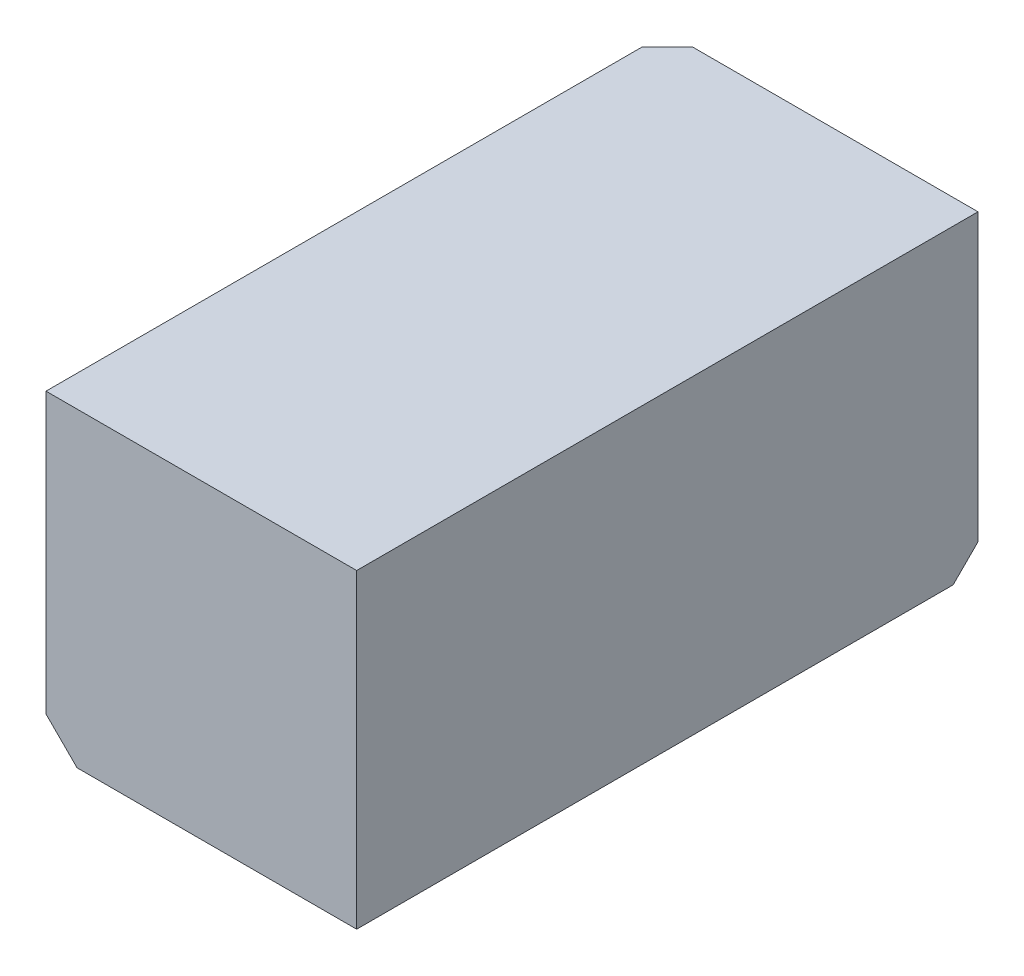
ISO-10303-21;
HEADER;
FILE_DESCRIPTION(('STEP AP214'),'2;1');
FILE_NAME('part.step','',(''),(''),'','','');
FILE_SCHEMA(('AUTOMOTIVE_DESIGN { 1 0 10303 214 1 1 1 1 }'));
ENDSEC;
DATA;
#1=APPLICATION_CONTEXT('core data for automotive mechanical design processes');
#2=APPLICATION_PROTOCOL_DEFINITION('international standard','automotive_design',2000,#1);
#3=PRODUCT_CONTEXT('',#1,'mechanical');
#4=PRODUCT('Part','Part','',(#3));
#5=PRODUCT_RELATED_PRODUCT_CATEGORY('part','',(#4));
#6=PRODUCT_DEFINITION_FORMATION('','',#4);
#7=PRODUCT_DEFINITION_CONTEXT('part definition',#1,'design');
#8=PRODUCT_DEFINITION('design','',#6,#7);
#9=PRODUCT_DEFINITION_SHAPE('','',#8);
#10=(LENGTH_UNIT() NAMED_UNIT(*) SI_UNIT(.MILLI.,.METRE.));
#11=(NAMED_UNIT(*) PLANE_ANGLE_UNIT() SI_UNIT($,.RADIAN.));
#12=(NAMED_UNIT(*) SI_UNIT($,.STERADIAN.) SOLID_ANGLE_UNIT());
#13=UNCERTAINTY_MEASURE_WITH_UNIT(LENGTH_MEASURE(1.E-05),#10,'distance_accuracy_value','');
#14=(GEOMETRIC_REPRESENTATION_CONTEXT(3) GLOBAL_UNCERTAINTY_ASSIGNED_CONTEXT((#13)) GLOBAL_UNIT_ASSIGNED_CONTEXT((#10,
#11,#12)) REPRESENTATION_CONTEXT('',''));
#15=CARTESIAN_POINT('',(0.,0.,0.));
#16=DIRECTION('',(0.,0.,1.));
#17=DIRECTION('',(1.,0.,0.));
#18=AXIS2_PLACEMENT_3D('',#15,#16,#17);
#19=CARTESIAN_POINT('',(-2.5,2.5,10.));
#20=DIRECTION('',(1.,0.,0.));
#21=DIRECTION('',(0.,0.,-1.));
#22=AXIS2_PLACEMENT_3D('',#19,#20,#21);
#23=PLANE('',#22);
#24=CARTESIAN_POINT('',(-2.5,0.,2.5));
#25=DIRECTION('',(-1.,0.,0.));
#26=DIRECTION('',(0.,0.,1.));
#27=AXIS2_PLACEMENT_3D('',#24,#25,#26);
#28=CIRCLE('',#27,1.6);
#29=CARTESIAN_POINT('',(-2.5,0.,4.1));
#30=VERTEX_POINT('',#29);
#31=EDGE_CURVE('E154',#30,#30,#28,.T.);
#32=ORIENTED_EDGE('',*,*,#31,.F.);
#33=EDGE_LOOP('',(#32));
#34=FACE_BOUND('',#33,.T.);
#35=DIRECTION('',(0.,0.,-1.));
#36=VECTOR('',#35,1.);
#37=CARTESIAN_POINT('',(-2.5,2.5,10.));
#38=LINE('',#37,#36);
#39=CARTESIAN_POINT('',(-2.5,2.5,10.));
#40=VERTEX_POINT('',#39);
#41=CARTESIAN_POINT('',(-2.5,2.5,0.4));
#42=VERTEX_POINT('',#41);
#43=EDGE_CURVE('E119',#40,#42,#38,.T.);
#44=ORIENTED_EDGE('',*,*,#43,.T.);
#45=DIRECTION('',(0.,-1.,0.));
#46=VECTOR('',#45,1.);
#47=CARTESIAN_POINT('',(-2.5,2.5,0.400000000000001));
#48=LINE('',#47,#46);
#49=CARTESIAN_POINT('',(-2.5,-2.,0.400000000000001));
#50=VERTEX_POINT('',#49);
#51=EDGE_CURVE('E136',#42,#50,#48,.T.);
#52=ORIENTED_EDGE('',*,*,#51,.T.);
#53=DIRECTION('',(0.,0.,1.));
#54=VECTOR('',#53,1.);
#55=CARTESIAN_POINT('',(-2.5,-2.,10.));
#56=LINE('',#55,#54);
#57=CARTESIAN_POINT('',(-2.5,-2.,10.));
#58=VERTEX_POINT('',#57);
#59=EDGE_CURVE('E133',#50,#58,#56,.T.);
#60=ORIENTED_EDGE('',*,*,#59,.T.);
#61=DIRECTION('',(0.,-1.,0.));
#62=VECTOR('',#61,1.);
#63=CARTESIAN_POINT('',(-2.5,2.5,10.));
#64=LINE('',#63,#62);
#65=EDGE_CURVE('E105',#40,#58,#64,.T.);
#66=ORIENTED_EDGE('',*,*,#65,.F.);
#67=EDGE_LOOP('',(#44,#52,#60,#66));
#68=FACE_BOUND('',#67,.T.);
#69=ADVANCED_FACE('F36',(#34,#68),#23,.F.);
#70=CARTESIAN_POINT('',(-2.5,-2.5,10.));
#71=DIRECTION('',(0.,1.,0.));
#72=DIRECTION('',(0.,0.,1.));
#73=AXIS2_PLACEMENT_3D('',#70,#71,#72);
#74=PLANE('',#73);
#75=CARTESIAN_POINT('',(0.,-2.5,7.5));
#76=DIRECTION('',(0.,-1.,0.));
#77=DIRECTION('',(0.,0.,-1.));
#78=AXIS2_PLACEMENT_3D('',#75,#76,#77);
#79=CIRCLE('',#78,1.6);
#80=CARTESIAN_POINT('',(0.,-2.5,5.9));
#81=VERTEX_POINT('',#80);
#82=EDGE_CURVE('E164',#81,#81,#79,.T.);
#83=ORIENTED_EDGE('',*,*,#82,.F.);
#84=EDGE_LOOP('',(#83));
#85=FACE_BOUND('',#84,.T.);
#86=DIRECTION('',(0.,0.,-1.));
#87=VECTOR('',#86,1.);
#88=CARTESIAN_POINT('',(-2.,-2.5,10.));
#89=LINE('',#88,#87);
#90=CARTESIAN_POINT('',(-2.,-2.5,10.));
#91=VERTEX_POINT('',#90);
#92=CARTESIAN_POINT('',(-2.,-2.5,0.400000000000001));
#93=VERTEX_POINT('',#92);
#94=EDGE_CURVE('E111',#91,#93,#89,.T.);
#95=ORIENTED_EDGE('',*,*,#94,.T.);
#96=DIRECTION('',(1.,0.,0.));
#97=VECTOR('',#96,1.);
#98=CARTESIAN_POINT('',(-2.5,-2.5,0.400000000000001));
#99=LINE('',#98,#97);
#100=CARTESIAN_POINT('',(2.5,-2.5,0.4));
#101=VERTEX_POINT('',#100);
#102=EDGE_CURVE('E45',#93,#101,#99,.T.);
#103=ORIENTED_EDGE('',*,*,#102,.T.);
#104=DIRECTION('',(0.,0.,-1.));
#105=VECTOR('',#104,1.);
#106=CARTESIAN_POINT('',(2.5,-2.5,10.));
#107=LINE('',#106,#105);
#108=CARTESIAN_POINT('',(2.5,-2.5,10.));
#109=VERTEX_POINT('',#108);
#110=EDGE_CURVE('E107',#109,#101,#107,.T.);
#111=ORIENTED_EDGE('',*,*,#110,.F.);
#112=DIRECTION('',(1.,0.,0.));
#113=VECTOR('',#112,1.);
#114=CARTESIAN_POINT('',(-2.5,-2.5,10.));
#115=LINE('',#114,#113);
#116=EDGE_CURVE('E97',#91,#109,#115,.T.);
#117=ORIENTED_EDGE('',*,*,#116,.F.);
#118=EDGE_LOOP('',(#95,#103,#111,#117));
#119=FACE_BOUND('',#118,.T.);
#120=ADVANCED_FACE('F108',(#85,#119),#74,.F.);
#121=CARTESIAN_POINT('',(2.5,2.5,10.));
#122=DIRECTION('',(-1.,0.,0.));
#123=DIRECTION('',(0.,0.,1.));
#124=AXIS2_PLACEMENT_3D('',#121,#122,#123);
#125=PLANE('',#124);
#126=ORIENTED_EDGE('',*,*,#110,.T.);
#127=DIRECTION('',(0.,-0.707106781186549,0.707106781186546));
#128=VECTOR('',#127,1.);
#129=CARTESIAN_POINT('',(2.5,-2.5,0.400000000000001));
#130=LINE('',#129,#128);
#131=CARTESIAN_POINT('',(2.5,-2.1,0.));
#132=VERTEX_POINT('',#131);
#133=EDGE_CURVE('E11',#101,#132,#130,.F.);
#134=ORIENTED_EDGE('',*,*,#133,.T.);
#135=DIRECTION('',(0.,1.,0.));
#136=VECTOR('',#135,1.);
#137=CARTESIAN_POINT('',(2.5,2.5,0.));
#138=LINE('',#137,#136);
#139=CARTESIAN_POINT('',(2.5,2.5,0.));
#140=VERTEX_POINT('',#139);
#141=EDGE_CURVE('E123',#132,#140,#138,.T.);
#142=ORIENTED_EDGE('',*,*,#141,.T.);
#143=DIRECTION('',(0.,0.,-1.));
#144=VECTOR('',#143,1.);
#145=CARTESIAN_POINT('',(2.5,2.5,10.));
#146=LINE('',#145,#144);
#147=CARTESIAN_POINT('',(2.5,2.5,10.));
#148=VERTEX_POINT('',#147);
#149=EDGE_CURVE('E112',#148,#140,#146,.T.);
#150=ORIENTED_EDGE('',*,*,#149,.F.);
#151=DIRECTION('',(0.,1.,0.));
#152=VECTOR('',#151,1.);
#153=CARTESIAN_POINT('',(2.5,2.5,10.));
#154=LINE('',#153,#152);
#155=EDGE_CURVE('E101',#109,#148,#154,.T.);
#156=ORIENTED_EDGE('',*,*,#155,.F.);
#157=EDGE_LOOP('',(#126,#134,#142,#150,#156));
#158=FACE_BOUND('',#157,.T.);
#159=ADVANCED_FACE('F114',(#158),#125,.F.);
#160=CARTESIAN_POINT('',(-2.5,2.5,10.));
#161=DIRECTION('',(0.,-1.,0.));
#162=DIRECTION('',(0.,0.,-1.));
#163=AXIS2_PLACEMENT_3D('',#160,#161,#162);
#164=PLANE('',#163);
#165=DIRECTION('',(-1.,0.,0.));
#166=VECTOR('',#165,1.);
#167=CARTESIAN_POINT('',(-2.5,2.5,0.));
#168=LINE('',#167,#166);
#169=CARTESIAN_POINT('',(-2.1,2.5,0.));
#170=VERTEX_POINT('',#169);
#171=EDGE_CURVE('E125',#140,#170,#168,.T.);
#172=ORIENTED_EDGE('',*,*,#171,.T.);
#173=DIRECTION('',(0.707106781186549,0.,-0.707106781186546));
#174=VECTOR('',#173,1.);
#175=CARTESIAN_POINT('',(-2.5,2.5,0.400000000000001));
#176=LINE('',#175,#174);
#177=EDGE_CURVE('E145',#170,#42,#176,.F.);
#178=ORIENTED_EDGE('',*,*,#177,.T.);
#179=ORIENTED_EDGE('',*,*,#43,.F.);
#180=DIRECTION('',(-1.,0.,0.));
#181=VECTOR('',#180,1.);
#182=CARTESIAN_POINT('',(-2.5,2.5,10.));
#183=LINE('',#182,#181);
#184=EDGE_CURVE('E117',#148,#40,#183,.T.);
#185=ORIENTED_EDGE('',*,*,#184,.F.);
#186=ORIENTED_EDGE('',*,*,#149,.T.);
#187=EDGE_LOOP('',(#172,#178,#179,#185,#186));
#188=FACE_BOUND('',#187,.T.);
#189=ADVANCED_FACE('F182',(#188),#164,.F.);
#190=CARTESIAN_POINT('',(0.,0.,10.));
#191=DIRECTION('',(0.,0.,1.));
#192=DIRECTION('',(1.,0.,0.));
#193=AXIS2_PLACEMENT_3D('',#190,#191,#192);
#194=PLANE('',#193);
#195=ORIENTED_EDGE('',*,*,#65,.T.);
#196=DIRECTION('',(-0.707106781186546,0.707106781186549,0.));
#197=VECTOR('',#196,1.);
#198=CARTESIAN_POINT('',(-2.25,-2.25,10.));
#199=LINE('',#198,#197);
#200=EDGE_CURVE('E104',#58,#91,#199,.F.);
#201=ORIENTED_EDGE('',*,*,#200,.T.);
#202=ORIENTED_EDGE('',*,*,#116,.T.);
#203=ORIENTED_EDGE('',*,*,#155,.T.);
#204=ORIENTED_EDGE('',*,*,#184,.T.);
#205=EDGE_LOOP('',(#195,#201,#202,#203,#204));
#206=FACE_BOUND('',#205,.T.);
#207=ADVANCED_FACE('F99',(#206),#194,.T.);
#208=CARTESIAN_POINT('',(0.,0.,0.));
#209=DIRECTION('',(0.,0.,1.));
#210=DIRECTION('',(1.,0.,0.));
#211=AXIS2_PLACEMENT_3D('',#208,#209,#210);
#212=PLANE('',#211);
#213=DIRECTION('',(-0.707106781186546,0.707106781186549,0.));
#214=VECTOR('',#213,1.);
#215=CARTESIAN_POINT('',(-2.21715728752538,-1.71715728752538,0.));
#216=LINE('',#215,#214);
#217=CARTESIAN_POINT('',(-1.83431457505076,-2.1,0.));
#218=VERTEX_POINT('',#217);
#219=CARTESIAN_POINT('',(-2.1,-1.83431457505076,0.));
#220=VERTEX_POINT('',#219);
#221=EDGE_CURVE('E141',#218,#220,#216,.T.);
#222=ORIENTED_EDGE('',*,*,#221,.T.);
#223=DIRECTION('',(0.,1.,0.));
#224=VECTOR('',#223,1.);
#225=CARTESIAN_POINT('',(-2.1,0.,0.));
#226=LINE('',#225,#224);
#227=EDGE_CURVE('E143',#220,#170,#226,.T.);
#228=ORIENTED_EDGE('',*,*,#227,.T.);
#229=ORIENTED_EDGE('',*,*,#171,.F.);
#230=ORIENTED_EDGE('',*,*,#141,.F.);
#231=DIRECTION('',(-1.,0.,0.));
#232=VECTOR('',#231,1.);
#233=CARTESIAN_POINT('',(0.,-2.1,0.));
#234=LINE('',#233,#232);
#235=EDGE_CURVE('E139',#132,#218,#234,.T.);
#236=ORIENTED_EDGE('',*,*,#235,.T.);
#237=EDGE_LOOP('',(#222,#228,#229,#230,#236));
#238=FACE_BOUND('',#237,.T.);
#239=ADVANCED_FACE('F179',(#238),#212,.F.);
#240=CARTESIAN_POINT('',(0.,2.,7.5));
#241=DIRECTION('',(0.,-1.,0.));
#242=DIRECTION('',(0.,0.,-1.));
#243=AXIS2_PLACEMENT_3D('',#240,#241,#242);
#244=CYLINDRICAL_SURFACE('',#243,1.6);
#245=CARTESIAN_POINT('',(0.,2.,7.5));
#246=DIRECTION('',(0.,-1.,0.));
#247=DIRECTION('',(0.,0.,-1.));
#248=AXIS2_PLACEMENT_3D('',#245,#246,#247);
#249=CIRCLE('',#248,1.6);
#250=CARTESIAN_POINT('',(0.,2.,5.9));
#251=VERTEX_POINT('',#250);
#252=EDGE_CURVE('E126',#251,#251,#249,.T.);
#253=ORIENTED_EDGE('',*,*,#252,.F.);
#254=EDGE_LOOP('',(#253));
#255=FACE_BOUND('',#254,.T.);
#256=ORIENTED_EDGE('',*,*,#82,.T.);
#257=EDGE_LOOP('',(#256));
#258=FACE_BOUND('',#257,.T.);
#259=ADVANCED_FACE('F233',(#255,#258),#244,.F.);
#260=CARTESIAN_POINT('',(0.,2.,7.5));
#261=DIRECTION('',(0.,-1.,0.));
#262=DIRECTION('',(0.,0.,-1.));
#263=AXIS2_PLACEMENT_3D('',#260,#261,#262);
#264=PLANE('',#263);
#265=ORIENTED_EDGE('',*,*,#252,.T.);
#266=EDGE_LOOP('',(#265));
#267=FACE_BOUND('',#266,.T.);
#268=ADVANCED_FACE('F225',(#267),#264,.T.);
#269=CARTESIAN_POINT('',(2.,0.,2.5));
#270=DIRECTION('',(-1.,0.,0.));
#271=DIRECTION('',(0.,0.,1.));
#272=AXIS2_PLACEMENT_3D('',#269,#270,#271);
#273=CYLINDRICAL_SURFACE('',#272,1.6);
#274=CARTESIAN_POINT('',(2.,0.,2.5));
#275=DIRECTION('',(-1.,0.,0.));
#276=DIRECTION('',(0.,0.,1.));
#277=AXIS2_PLACEMENT_3D('',#274,#275,#276);
#278=CIRCLE('',#277,1.6);
#279=CARTESIAN_POINT('',(2.,0.,4.1));
#280=VERTEX_POINT('',#279);
#281=EDGE_CURVE('E159',#280,#280,#278,.T.);
#282=ORIENTED_EDGE('',*,*,#281,.F.);
#283=EDGE_LOOP('',(#282));
#284=FACE_BOUND('',#283,.T.);
#285=ORIENTED_EDGE('',*,*,#31,.T.);
#286=EDGE_LOOP('',(#285));
#287=FACE_BOUND('',#286,.T.);
#288=ADVANCED_FACE('F216',(#284,#287),#273,.F.);
#289=CARTESIAN_POINT('',(2.,0.,2.5));
#290=DIRECTION('',(-1.,0.,0.));
#291=DIRECTION('',(0.,0.,1.));
#292=AXIS2_PLACEMENT_3D('',#289,#290,#291);
#293=PLANE('',#292);
#294=ORIENTED_EDGE('',*,*,#281,.T.);
#295=EDGE_LOOP('',(#294));
#296=FACE_BOUND('',#295,.T.);
#297=ADVANCED_FACE('F196',(#296),#293,.T.);
#298=CARTESIAN_POINT('',(-2.,-2.5,10.));
#299=DIRECTION('',(0.707106781186549,0.707106781186546,0.));
#300=DIRECTION('',(0.,0.,-1.));
#301=AXIS2_PLACEMENT_3D('',#298,#299,#300);
#302=PLANE('',#301);
#303=ORIENTED_EDGE('',*,*,#59,.F.);
#304=DIRECTION('',(-0.707106781186546,0.707106781186549,0.));
#305=VECTOR('',#304,1.);
#306=CARTESIAN_POINT('',(-2.,-2.5,0.400000000000001));
#307=LINE('',#306,#305);
#308=EDGE_CURVE('E60',#50,#93,#307,.F.);
#309=ORIENTED_EDGE('',*,*,#308,.T.);
#310=ORIENTED_EDGE('',*,*,#94,.F.);
#311=ORIENTED_EDGE('',*,*,#200,.F.);
#312=EDGE_LOOP('',(#303,#309,#310,#311));
#313=FACE_BOUND('',#312,.T.);
#314=ADVANCED_FACE('F173',(#313),#302,.F.);
#315=CARTESIAN_POINT('',(-2.5,-2.5,0.400000000000001));
#316=DIRECTION('',(0.,0.707106781186546,0.707106781186549));
#317=DIRECTION('',(1.,0.,0.));
#318=AXIS2_PLACEMENT_3D('',#315,#316,#317);
#319=PLANE('',#318);
#320=ORIENTED_EDGE('',*,*,#133,.F.);
#321=ORIENTED_EDGE('',*,*,#102,.F.);
#322=DIRECTION('',(0.281084637714821,0.678598344545848,-0.678598344545845));
#323=VECTOR('',#322,1.);
#324=CARTESIAN_POINT('',(-2.03950428677964,-2.59537178491527,0.495371784915274));
#325=LINE('',#324,#323);
#326=EDGE_CURVE('E40',#218,#93,#325,.F.);
#327=ORIENTED_EDGE('',*,*,#326,.F.);
#328=ORIENTED_EDGE('',*,*,#235,.F.);
#329=EDGE_LOOP('',(#320,#321,#327,#328));
#330=FACE_BOUND('',#329,.T.);
#331=ADVANCED_FACE('F38',(#330),#319,.F.);
#332=CARTESIAN_POINT('',(-1.96715728752538,-1.96715728752538,0.));
#333=DIRECTION('',(0.5,0.499999999999998,0.707106781186549));
#334=DIRECTION('',(-0.707106781186546,0.707106781186549,0.));
#335=AXIS2_PLACEMENT_3D('',#332,#333,#334);
#336=PLANE('',#335);
#337=ORIENTED_EDGE('',*,*,#326,.T.);
#338=ORIENTED_EDGE('',*,*,#308,.F.);
#339=DIRECTION('',(0.678598344545848,0.28108463771482,-0.678598344545846));
#340=VECTOR('',#339,1.);
#341=CARTESIAN_POINT('',(-2.06416539357625,-1.81947139506774,-0.0358346064237448));
#342=LINE('',#341,#340);
#343=EDGE_CURVE('E148',#220,#50,#342,.F.);
#344=ORIENTED_EDGE('',*,*,#343,.F.);
#345=ORIENTED_EDGE('',*,*,#221,.F.);
#346=EDGE_LOOP('',(#337,#338,#344,#345));
#347=FACE_BOUND('',#346,.T.);
#348=ADVANCED_FACE('F198',(#347),#336,.F.);
#349=CARTESIAN_POINT('',(-2.5,2.5,0.400000000000001));
#350=DIRECTION('',(0.707106781186546,0.,0.707106781186549));
#351=DIRECTION('',(0.,-1.,0.));
#352=AXIS2_PLACEMENT_3D('',#349,#350,#351);
#353=PLANE('',#352);
#354=ORIENTED_EDGE('',*,*,#177,.F.);
#355=ORIENTED_EDGE('',*,*,#227,.F.);
#356=ORIENTED_EDGE('',*,*,#343,.T.);
#357=ORIENTED_EDGE('',*,*,#51,.F.);
#358=EDGE_LOOP('',(#354,#355,#356,#357));
#359=FACE_BOUND('',#358,.T.);
#360=ADVANCED_FACE('F183',(#359),#353,.F.);
#361=CLOSED_SHELL('',(#69,#120,#159,#189,#207,#239,#259,#268,#288,#297,#314,#331,#348,#360));
#362=MANIFOLD_SOLID_BREP('B2',#361);
#363=ADVANCED_BREP_SHAPE_REPRESENTATION('',(#18,#362),#14);
#364=SHAPE_DEFINITION_REPRESENTATION(#9,#363);
ENDSEC;
END-ISO-10303-21;
